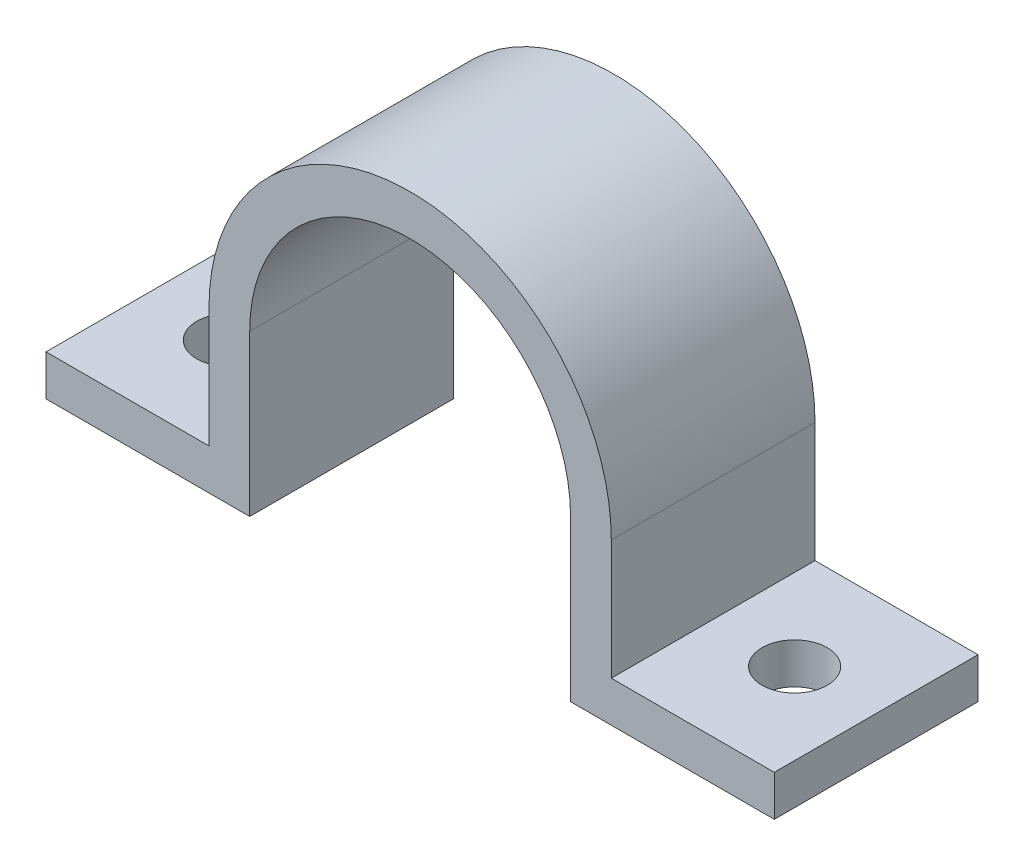
ISO-10303-21;
HEADER;
FILE_DESCRIPTION(('STEP AP214'),'2;1');
FILE_NAME('part.step','',(''),(''),'','','');
FILE_SCHEMA(('AUTOMOTIVE_DESIGN { 1 0 10303 214 1 1 1 1 }'));
ENDSEC;
DATA;
#1=APPLICATION_CONTEXT('core data for automotive mechanical design processes');
#2=APPLICATION_PROTOCOL_DEFINITION('international standard','automotive_design',2000,#1);
#3=PRODUCT_CONTEXT('',#1,'mechanical');
#4=PRODUCT('Part','Part','',(#3));
#5=PRODUCT_RELATED_PRODUCT_CATEGORY('part','',(#4));
#6=PRODUCT_DEFINITION_FORMATION('','',#4);
#7=PRODUCT_DEFINITION_CONTEXT('part definition',#1,'design');
#8=PRODUCT_DEFINITION('design','',#6,#7);
#9=PRODUCT_DEFINITION_SHAPE('','',#8);
#10=(LENGTH_UNIT() NAMED_UNIT(*) SI_UNIT(.MILLI.,.METRE.));
#11=(NAMED_UNIT(*) PLANE_ANGLE_UNIT() SI_UNIT($,.RADIAN.));
#12=(NAMED_UNIT(*) SI_UNIT($,.STERADIAN.) SOLID_ANGLE_UNIT());
#13=UNCERTAINTY_MEASURE_WITH_UNIT(LENGTH_MEASURE(1.E-05),#10,'distance_accuracy_value','');
#14=(GEOMETRIC_REPRESENTATION_CONTEXT(3) GLOBAL_UNCERTAINTY_ASSIGNED_CONTEXT((#13)) GLOBAL_UNIT_ASSIGNED_CONTEXT((#10,
#11,#12)) REPRESENTATION_CONTEXT('',''));
#15=CARTESIAN_POINT('',(0.,0.,0.));
#16=DIRECTION('',(0.,0.,1.));
#17=DIRECTION('',(1.,0.,0.));
#18=AXIS2_PLACEMENT_3D('',#15,#16,#17);
#19=CARTESIAN_POINT('',(0.836483509189198,-0.00257229477925586,12.7));
#20=DIRECTION('',(0.,0.,-1.));
#21=DIRECTION('',(-1.,0.,0.));
#22=AXIS2_PLACEMENT_3D('',#19,#20,#21);
#23=CYLINDRICAL_SURFACE('',#22,10.0000054);
#24=CARTESIAN_POINT('',(0.836483509189198,-0.00257229477925586,0.));
#25=DIRECTION('',(0.,0.,-1.));
#26=DIRECTION('',(-1.,0.,0.));
#27=AXIS2_PLACEMENT_3D('',#24,#25,#26);
#28=CIRCLE('',#27,10.0000054);
#29=CARTESIAN_POINT('',(-9.1635218908108,-0.00257229477925586,0.));
#30=VERTEX_POINT('',#29);
#31=CARTESIAN_POINT('',(10.8364889091892,-0.00257229477925218,0.));
#32=VERTEX_POINT('',#31);
#33=EDGE_CURVE('E182',#30,#32,#28,.T.);
#34=ORIENTED_EDGE('',*,*,#33,.T.);
#35=DIRECTION('',(0.,0.,-1.));
#36=VECTOR('',#35,1.);
#37=CARTESIAN_POINT('',(10.8364889091892,-0.00257229477925218,12.7));
#38=LINE('',#37,#36);
#39=CARTESIAN_POINT('',(10.8364889091892,-0.00257229477925218,12.7));
#40=VERTEX_POINT('',#39);
#41=EDGE_CURVE('E11',#40,#32,#38,.T.);
#42=ORIENTED_EDGE('',*,*,#41,.F.);
#43=CARTESIAN_POINT('',(0.836483509189198,-0.00257229477925586,12.7));
#44=DIRECTION('',(0.,0.,-1.));
#45=DIRECTION('',(-1.,0.,0.));
#46=AXIS2_PLACEMENT_3D('',#43,#44,#45);
#47=CIRCLE('',#46,10.0000054);
#48=CARTESIAN_POINT('',(-9.1635218908108,-0.00257229477925586,12.7));
#49=VERTEX_POINT('',#48);
#50=EDGE_CURVE('E217',#49,#40,#47,.T.);
#51=ORIENTED_EDGE('',*,*,#50,.F.);
#52=DIRECTION('',(0.,0.,-1.));
#53=VECTOR('',#52,1.);
#54=CARTESIAN_POINT('',(-9.1635218908108,-0.00257229477925586,12.7));
#55=LINE('',#54,#53);
#56=EDGE_CURVE('E178',#49,#30,#55,.T.);
#57=ORIENTED_EDGE('',*,*,#56,.T.);
#58=EDGE_LOOP('',(#34,#42,#51,#57));
#59=FACE_BOUND('',#58,.T.);
#60=ADVANCED_FACE('F43',(#59),#23,.F.);
#61=CARTESIAN_POINT('',(10.8364889091892,-0.00257229477925218,12.7));
#62=DIRECTION('',(1.,0.,0.));
#63=DIRECTION('',(0.,1.,0.));
#64=AXIS2_PLACEMENT_3D('',#61,#62,#63);
#65=PLANE('',#64);
#66=DIRECTION('',(0.,-1.,0.));
#67=VECTOR('',#66,1.);
#68=CARTESIAN_POINT('',(10.8364889091892,-0.00257229477925218,0.));
#69=LINE('',#68,#67);
#70=CARTESIAN_POINT('',(10.8364889091892,-10.0025776947793,0.));
#71=VERTEX_POINT('',#70);
#72=EDGE_CURVE('E186',#32,#71,#69,.T.);
#73=ORIENTED_EDGE('',*,*,#72,.T.);
#74=DIRECTION('',(0.,0.,-1.));
#75=VECTOR('',#74,1.);
#76=CARTESIAN_POINT('',(10.8364889091892,-10.0025776947793,12.7));
#77=LINE('',#76,#75);
#78=CARTESIAN_POINT('',(10.8364889091892,-10.0025776947793,12.7));
#79=VERTEX_POINT('',#78);
#80=EDGE_CURVE('E53',#79,#71,#77,.T.);
#81=ORIENTED_EDGE('',*,*,#80,.F.);
#82=DIRECTION('',(0.,-1.,0.));
#83=VECTOR('',#82,1.);
#84=CARTESIAN_POINT('',(10.8364889091892,-0.00257229477925218,12.7));
#85=LINE('',#84,#83);
#86=EDGE_CURVE('E127',#40,#79,#85,.T.);
#87=ORIENTED_EDGE('',*,*,#86,.F.);
#88=ORIENTED_EDGE('',*,*,#41,.T.);
#89=EDGE_LOOP('',(#73,#81,#87,#88));
#90=FACE_BOUND('',#89,.T.);
#91=ADVANCED_FACE('F313',(#90),#65,.F.);
#92=CARTESIAN_POINT('',(10.8364889091892,-10.0025776947793,12.7));
#93=DIRECTION('',(0.,1.,0.));
#94=DIRECTION('',(0.,0.,1.));
#95=AXIS2_PLACEMENT_3D('',#92,#93,#94);
#96=PLANE('',#95);
#97=CARTESIAN_POINT('',(18.4564889091892,-10.0025776947793,6.35));
#98=DIRECTION('',(0.,1.,0.));
#99=DIRECTION('',(0.,0.,1.));
#100=AXIS2_PLACEMENT_3D('',#97,#98,#99);
#101=CIRCLE('',#100,2.032);
#102=CARTESIAN_POINT('',(18.4564889091892,-10.0025776947793,8.382));
#103=VERTEX_POINT('',#102);
#104=EDGE_CURVE('E187',#103,#103,#101,.T.);
#105=ORIENTED_EDGE('',*,*,#104,.T.);
#106=EDGE_LOOP('',(#105));
#107=FACE_BOUND('',#106,.T.);
#108=DIRECTION('',(1.,0.,0.));
#109=VECTOR('',#108,1.);
#110=CARTESIAN_POINT('',(10.8364889091892,-10.0025776947793,0.));
#111=LINE('',#110,#109);
#112=CARTESIAN_POINT('',(23.5364889091892,-10.0025776947793,0.));
#113=VERTEX_POINT('',#112);
#114=EDGE_CURVE('E190',#71,#113,#111,.T.);
#115=ORIENTED_EDGE('',*,*,#114,.T.);
#116=DIRECTION('',(0.,0.,-1.));
#117=VECTOR('',#116,1.);
#118=CARTESIAN_POINT('',(23.5364889091892,-10.0025776947793,12.7));
#119=LINE('',#118,#117);
#120=CARTESIAN_POINT('',(23.5364889091892,-10.0025776947793,12.7));
#121=VERTEX_POINT('',#120);
#122=EDGE_CURVE('E244',#121,#113,#119,.T.);
#123=ORIENTED_EDGE('',*,*,#122,.F.);
#124=DIRECTION('',(1.,0.,0.));
#125=VECTOR('',#124,1.);
#126=CARTESIAN_POINT('',(10.8364889091892,-10.0025776947793,12.7));
#127=LINE('',#126,#125);
#128=EDGE_CURVE('E255',#79,#121,#127,.T.);
#129=ORIENTED_EDGE('',*,*,#128,.F.);
#130=ORIENTED_EDGE('',*,*,#80,.T.);
#131=EDGE_LOOP('',(#115,#123,#129,#130));
#132=FACE_BOUND('',#131,.T.);
#133=ADVANCED_FACE('F253',(#107,#132),#96,.F.);
#134=CARTESIAN_POINT('',(23.5364889091892,-10.0025776947793,12.7));
#135=DIRECTION('',(-1.,0.,0.));
#136=DIRECTION('',(0.,0.,1.));
#137=AXIS2_PLACEMENT_3D('',#134,#135,#136);
#138=PLANE('',#137);
#139=DIRECTION('',(0.,1.,0.));
#140=VECTOR('',#139,1.);
#141=CARTESIAN_POINT('',(23.5364889091892,-10.0025776947793,0.));
#142=LINE('',#141,#140);
#143=CARTESIAN_POINT('',(23.5364889091892,-7.46257769477926,0.));
#144=VERTEX_POINT('',#143);
#145=EDGE_CURVE('E193',#113,#144,#142,.T.);
#146=ORIENTED_EDGE('',*,*,#145,.T.);
#147=DIRECTION('',(0.,0.,-1.));
#148=VECTOR('',#147,1.);
#149=CARTESIAN_POINT('',(23.5364889091892,-7.46257769477926,12.7));
#150=LINE('',#149,#148);
#151=CARTESIAN_POINT('',(23.5364889091892,-7.46257769477926,12.7));
#152=VERTEX_POINT('',#151);
#153=EDGE_CURVE('E240',#152,#144,#150,.T.);
#154=ORIENTED_EDGE('',*,*,#153,.F.);
#155=DIRECTION('',(0.,1.,0.));
#156=VECTOR('',#155,1.);
#157=CARTESIAN_POINT('',(23.5364889091892,-10.0025776947793,12.7));
#158=LINE('',#157,#156);
#159=EDGE_CURVE('E274',#121,#152,#158,.T.);
#160=ORIENTED_EDGE('',*,*,#159,.F.);
#161=ORIENTED_EDGE('',*,*,#122,.T.);
#162=EDGE_LOOP('',(#146,#154,#160,#161));
#163=FACE_BOUND('',#162,.T.);
#164=ADVANCED_FACE('F264',(#163),#138,.F.);
#165=CARTESIAN_POINT('',(13.3764889091892,-7.46257769477926,12.7));
#166=DIRECTION('',(0.,-1.,0.));
#167=DIRECTION('',(1.,0.,0.));
#168=AXIS2_PLACEMENT_3D('',#165,#166,#167);
#169=PLANE('',#168);
#170=CARTESIAN_POINT('',(18.4564889091892,-7.46257769477926,6.35));
#171=DIRECTION('',(0.,1.,0.));
#172=DIRECTION('',(0.,0.,1.));
#173=AXIS2_PLACEMENT_3D('',#170,#171,#172);
#174=CIRCLE('',#173,2.032);
#175=CARTESIAN_POINT('',(18.4564889091892,-7.46257769477926,8.382));
#176=VERTEX_POINT('',#175);
#177=EDGE_CURVE('E425',#176,#176,#174,.T.);
#178=ORIENTED_EDGE('',*,*,#177,.F.);
#179=EDGE_LOOP('',(#178));
#180=FACE_BOUND('',#179,.T.);
#181=DIRECTION('',(-1.,0.,0.));
#182=VECTOR('',#181,1.);
#183=CARTESIAN_POINT('',(13.3764889091892,-7.46257769477926,0.));
#184=LINE('',#183,#182);
#185=CARTESIAN_POINT('',(13.3764889091892,-7.46257769477926,0.));
#186=VERTEX_POINT('',#185);
#187=EDGE_CURVE('E196',#144,#186,#184,.T.);
#188=ORIENTED_EDGE('',*,*,#187,.T.);
#189=DIRECTION('',(0.,0.,-1.));
#190=VECTOR('',#189,1.);
#191=CARTESIAN_POINT('',(13.3764889091892,-7.46257769477926,12.7));
#192=LINE('',#191,#190);
#193=CARTESIAN_POINT('',(13.3764889091892,-7.46257769477926,12.7));
#194=VERTEX_POINT('',#193);
#195=EDGE_CURVE('E236',#194,#186,#192,.T.);
#196=ORIENTED_EDGE('',*,*,#195,.F.);
#197=DIRECTION('',(-1.,0.,0.));
#198=VECTOR('',#197,1.);
#199=CARTESIAN_POINT('',(13.3764889091892,-7.46257769477926,12.7));
#200=LINE('',#199,#198);
#201=EDGE_CURVE('E270',#152,#194,#200,.T.);
#202=ORIENTED_EDGE('',*,*,#201,.F.);
#203=ORIENTED_EDGE('',*,*,#153,.T.);
#204=EDGE_LOOP('',(#188,#196,#202,#203));
#205=FACE_BOUND('',#204,.T.);
#206=ADVANCED_FACE('F268',(#180,#205),#169,.F.);
#207=CARTESIAN_POINT('',(13.3764889091892,-0.00257229477925586,12.7));
#208=DIRECTION('',(-1.,0.,0.));
#209=DIRECTION('',(0.,-1.,0.));
#210=AXIS2_PLACEMENT_3D('',#207,#208,#209);
#211=PLANE('',#210);
#212=DIRECTION('',(0.,1.,0.));
#213=VECTOR('',#212,1.);
#214=CARTESIAN_POINT('',(13.3764889091892,-0.00257229477925586,0.));
#215=LINE('',#214,#213);
#216=CARTESIAN_POINT('',(13.3764889091892,-0.00257229477925586,0.));
#217=VERTEX_POINT('',#216);
#218=EDGE_CURVE('E199',#186,#217,#215,.T.);
#219=ORIENTED_EDGE('',*,*,#218,.T.);
#220=DIRECTION('',(0.,0.,-1.));
#221=VECTOR('',#220,1.);
#222=CARTESIAN_POINT('',(13.3764889091892,-0.00257229477925586,12.7));
#223=LINE('',#222,#221);
#224=CARTESIAN_POINT('',(13.3764889091892,-0.00257229477925586,12.7));
#225=VERTEX_POINT('',#224);
#226=EDGE_CURVE('E232',#225,#217,#223,.T.);
#227=ORIENTED_EDGE('',*,*,#226,.F.);
#228=DIRECTION('',(0.,1.,0.));
#229=VECTOR('',#228,1.);
#230=CARTESIAN_POINT('',(13.3764889091892,-0.00257229477925586,12.7));
#231=LINE('',#230,#229);
#232=EDGE_CURVE('E273',#194,#225,#231,.T.);
#233=ORIENTED_EDGE('',*,*,#232,.F.);
#234=ORIENTED_EDGE('',*,*,#195,.T.);
#235=EDGE_LOOP('',(#219,#227,#233,#234));
#236=FACE_BOUND('',#235,.T.);
#237=ADVANCED_FACE('F327',(#236),#211,.F.);
#238=CARTESIAN_POINT('',(0.836483509189198,-0.00257229477925586,12.7));
#239=DIRECTION('',(0.,0.,-1.));
#240=DIRECTION('',(-1.,0.,0.));
#241=AXIS2_PLACEMENT_3D('',#238,#239,#240);
#242=CYLINDRICAL_SURFACE('',#241,12.5400054);
#243=CARTESIAN_POINT('',(0.836483509189198,-0.00257229477925586,0.));
#244=DIRECTION('',(0.,0.,1.));
#245=DIRECTION('',(-1.,0.,0.));
#246=AXIS2_PLACEMENT_3D('',#243,#244,#245);
#247=CIRCLE('',#246,12.5400054);
#248=CARTESIAN_POINT('',(-11.7035218908108,-0.00257229477925586,0.));
#249=VERTEX_POINT('',#248);
#250=EDGE_CURVE('E202',#217,#249,#247,.T.);
#251=ORIENTED_EDGE('',*,*,#250,.T.);
#252=DIRECTION('',(0.,0.,-1.));
#253=VECTOR('',#252,1.);
#254=CARTESIAN_POINT('',(-11.7035218908108,-0.00257229477925586,12.7));
#255=LINE('',#254,#253);
#256=CARTESIAN_POINT('',(-11.7035218908108,-0.00257229477925586,12.7));
#257=VERTEX_POINT('',#256);
#258=EDGE_CURVE('E228',#257,#249,#255,.T.);
#259=ORIENTED_EDGE('',*,*,#258,.F.);
#260=CARTESIAN_POINT('',(0.836483509189198,-0.00257229477925586,12.7));
#261=DIRECTION('',(0.,0.,1.));
#262=DIRECTION('',(-1.,0.,0.));
#263=AXIS2_PLACEMENT_3D('',#260,#261,#262);
#264=CIRCLE('',#263,12.5400054);
#265=EDGE_CURVE('E278',#225,#257,#264,.T.);
#266=ORIENTED_EDGE('',*,*,#265,.F.);
#267=ORIENTED_EDGE('',*,*,#226,.T.);
#268=EDGE_LOOP('',(#251,#259,#266,#267));
#269=FACE_BOUND('',#268,.T.);
#270=ADVANCED_FACE('F331',(#269),#242,.T.);
#271=CARTESIAN_POINT('',(-11.7035218908108,-0.00257229477925586,12.7));
#272=DIRECTION('',(1.,0.,0.));
#273=DIRECTION('',(0.,1.,0.));
#274=AXIS2_PLACEMENT_3D('',#271,#272,#273);
#275=PLANE('',#274);
#276=DIRECTION('',(0.,-1.,0.));
#277=VECTOR('',#276,1.);
#278=CARTESIAN_POINT('',(-11.7035218908108,-0.00257229477925586,0.));
#279=LINE('',#278,#277);
#280=CARTESIAN_POINT('',(-11.7035218908108,-7.46257769477926,0.));
#281=VERTEX_POINT('',#280);
#282=EDGE_CURVE('E205',#249,#281,#279,.T.);
#283=ORIENTED_EDGE('',*,*,#282,.T.);
#284=DIRECTION('',(0.,0.,-1.));
#285=VECTOR('',#284,1.);
#286=CARTESIAN_POINT('',(-11.7035218908108,-7.46257769477926,12.7));
#287=LINE('',#286,#285);
#288=CARTESIAN_POINT('',(-11.7035218908108,-7.46257769477926,12.7));
#289=VERTEX_POINT('',#288);
#290=EDGE_CURVE('E224',#289,#281,#287,.T.);
#291=ORIENTED_EDGE('',*,*,#290,.F.);
#292=DIRECTION('',(0.,-1.,0.));
#293=VECTOR('',#292,1.);
#294=CARTESIAN_POINT('',(-11.7035218908108,-0.00257229477925586,12.7));
#295=LINE('',#294,#293);
#296=EDGE_CURVE('E285',#257,#289,#295,.T.);
#297=ORIENTED_EDGE('',*,*,#296,.F.);
#298=ORIENTED_EDGE('',*,*,#258,.T.);
#299=EDGE_LOOP('',(#283,#291,#297,#298));
#300=FACE_BOUND('',#299,.T.);
#301=ADVANCED_FACE('F293',(#300),#275,.F.);
#302=CARTESIAN_POINT('',(-21.8635218908108,-7.46257769477926,12.7));
#303=DIRECTION('',(0.,-1.,0.));
#304=DIRECTION('',(0.,0.,-1.));
#305=AXIS2_PLACEMENT_3D('',#302,#303,#304);
#306=PLANE('',#305);
#307=CARTESIAN_POINT('',(-16.7835218908108,-7.46257769477926,6.35));
#308=DIRECTION('',(0.,1.,0.));
#309=DIRECTION('',(0.,0.,1.));
#310=AXIS2_PLACEMENT_3D('',#307,#308,#309);
#311=CIRCLE('',#310,2.032);
#312=CARTESIAN_POINT('',(-16.7835218908108,-7.46257769477926,8.382));
#313=VERTEX_POINT('',#312);
#314=EDGE_CURVE('E432',#313,#313,#311,.T.);
#315=ORIENTED_EDGE('',*,*,#314,.F.);
#316=EDGE_LOOP('',(#315));
#317=FACE_BOUND('',#316,.T.);
#318=DIRECTION('',(-1.,0.,0.));
#319=VECTOR('',#318,1.);
#320=CARTESIAN_POINT('',(-21.8635218908108,-7.46257769477926,0.));
#321=LINE('',#320,#319);
#322=CARTESIAN_POINT('',(-21.8635218908108,-7.46257769477926,0.));
#323=VERTEX_POINT('',#322);
#324=EDGE_CURVE('E208',#281,#323,#321,.T.);
#325=ORIENTED_EDGE('',*,*,#324,.T.);
#326=DIRECTION('',(0.,0.,-1.));
#327=VECTOR('',#326,1.);
#328=CARTESIAN_POINT('',(-21.8635218908108,-7.46257769477926,12.7));
#329=LINE('',#328,#327);
#330=CARTESIAN_POINT('',(-21.8635218908108,-7.46257769477926,12.7));
#331=VERTEX_POINT('',#330);
#332=EDGE_CURVE('E171',#331,#323,#329,.T.);
#333=ORIENTED_EDGE('',*,*,#332,.F.);
#334=DIRECTION('',(-1.,0.,0.));
#335=VECTOR('',#334,1.);
#336=CARTESIAN_POINT('',(-21.8635218908108,-7.46257769477926,12.7));
#337=LINE('',#336,#335);
#338=EDGE_CURVE('E160',#289,#331,#337,.T.);
#339=ORIENTED_EDGE('',*,*,#338,.F.);
#340=ORIENTED_EDGE('',*,*,#290,.T.);
#341=EDGE_LOOP('',(#325,#333,#339,#340));
#342=FACE_BOUND('',#341,.T.);
#343=ADVANCED_FACE('F297',(#317,#342),#306,.F.);
#344=CARTESIAN_POINT('',(-21.8635218908108,-10.0025776947793,12.7));
#345=DIRECTION('',(1.,0.,0.));
#346=DIRECTION('',(0.,0.,-1.));
#347=AXIS2_PLACEMENT_3D('',#344,#345,#346);
#348=PLANE('',#347);
#349=DIRECTION('',(0.,-1.,0.));
#350=VECTOR('',#349,1.);
#351=CARTESIAN_POINT('',(-21.8635218908108,-10.0025776947793,0.));
#352=LINE('',#351,#350);
#353=CARTESIAN_POINT('',(-21.8635218908108,-10.0025776947793,0.));
#354=VERTEX_POINT('',#353);
#355=EDGE_CURVE('E169',#323,#354,#352,.T.);
#356=ORIENTED_EDGE('',*,*,#355,.T.);
#357=DIRECTION('',(0.,0.,-1.));
#358=VECTOR('',#357,1.);
#359=CARTESIAN_POINT('',(-21.8635218908108,-10.0025776947793,12.7));
#360=LINE('',#359,#358);
#361=CARTESIAN_POINT('',(-21.8635218908108,-10.0025776947793,12.7));
#362=VERTEX_POINT('',#361);
#363=EDGE_CURVE('E166',#362,#354,#360,.T.);
#364=ORIENTED_EDGE('',*,*,#363,.F.);
#365=DIRECTION('',(0.,-1.,0.));
#366=VECTOR('',#365,1.);
#367=CARTESIAN_POINT('',(-21.8635218908108,-10.0025776947793,12.7));
#368=LINE('',#367,#366);
#369=EDGE_CURVE('E154',#331,#362,#368,.T.);
#370=ORIENTED_EDGE('',*,*,#369,.F.);
#371=ORIENTED_EDGE('',*,*,#332,.T.);
#372=EDGE_LOOP('',(#356,#364,#370,#371));
#373=FACE_BOUND('',#372,.T.);
#374=ADVANCED_FACE('F167',(#373),#348,.F.);
#375=CARTESIAN_POINT('',(-9.1635218908108,-10.0025776947793,12.7));
#376=DIRECTION('',(0.,1.,0.));
#377=DIRECTION('',(0.,0.,1.));
#378=AXIS2_PLACEMENT_3D('',#375,#376,#377);
#379=PLANE('',#378);
#380=CARTESIAN_POINT('',(-16.7835218908108,-10.0025776947793,6.35));
#381=DIRECTION('',(0.,1.,0.));
#382=DIRECTION('',(0.,0.,1.));
#383=AXIS2_PLACEMENT_3D('',#380,#381,#382);
#384=CIRCLE('',#383,2.032);
#385=CARTESIAN_POINT('',(-16.7835218908108,-10.0025776947793,8.382));
#386=VERTEX_POINT('',#385);
#387=EDGE_CURVE('E46',#386,#386,#384,.T.);
#388=ORIENTED_EDGE('',*,*,#387,.T.);
#389=EDGE_LOOP('',(#388));
#390=FACE_BOUND('',#389,.T.);
#391=DIRECTION('',(1.,0.,0.));
#392=VECTOR('',#391,1.);
#393=CARTESIAN_POINT('',(-9.1635218908108,-10.0025776947793,0.));
#394=LINE('',#393,#392);
#395=CARTESIAN_POINT('',(-9.1635218908108,-10.0025776947793,0.));
#396=VERTEX_POINT('',#395);
#397=EDGE_CURVE('E113',#354,#396,#394,.T.);
#398=ORIENTED_EDGE('',*,*,#397,.T.);
#399=DIRECTION('',(0.,0.,-1.));
#400=VECTOR('',#399,1.);
#401=CARTESIAN_POINT('',(-9.1635218908108,-10.0025776947793,12.7));
#402=LINE('',#401,#400);
#403=CARTESIAN_POINT('',(-9.1635218908108,-10.0025776947793,12.7));
#404=VERTEX_POINT('',#403);
#405=EDGE_CURVE('E172',#404,#396,#402,.T.);
#406=ORIENTED_EDGE('',*,*,#405,.F.);
#407=DIRECTION('',(1.,0.,0.));
#408=VECTOR('',#407,1.);
#409=CARTESIAN_POINT('',(-9.1635218908108,-10.0025776947793,12.7));
#410=LINE('',#409,#408);
#411=EDGE_CURVE('E158',#362,#404,#410,.T.);
#412=ORIENTED_EDGE('',*,*,#411,.F.);
#413=ORIENTED_EDGE('',*,*,#363,.T.);
#414=EDGE_LOOP('',(#398,#406,#412,#413));
#415=FACE_BOUND('',#414,.T.);
#416=ADVANCED_FACE('F174',(#390,#415),#379,.F.);
#417=CARTESIAN_POINT('',(-9.1635218908108,-0.00257229477925586,12.7));
#418=DIRECTION('',(-1.,0.,0.));
#419=DIRECTION('',(0.,0.,1.));
#420=AXIS2_PLACEMENT_3D('',#417,#418,#419);
#421=PLANE('',#420);
#422=DIRECTION('',(0.,1.,0.));
#423=VECTOR('',#422,1.);
#424=CARTESIAN_POINT('',(-9.1635218908108,-0.00257229477925586,0.));
#425=LINE('',#424,#423);
#426=EDGE_CURVE('E119',#396,#30,#425,.T.);
#427=ORIENTED_EDGE('',*,*,#426,.T.);
#428=ORIENTED_EDGE('',*,*,#56,.F.);
#429=DIRECTION('',(0.,1.,0.));
#430=VECTOR('',#429,1.);
#431=CARTESIAN_POINT('',(-9.1635218908108,-0.00257229477925586,12.7));
#432=LINE('',#431,#430);
#433=EDGE_CURVE('E64',#404,#49,#432,.T.);
#434=ORIENTED_EDGE('',*,*,#433,.F.);
#435=ORIENTED_EDGE('',*,*,#405,.T.);
#436=EDGE_LOOP('',(#427,#428,#434,#435));
#437=FACE_BOUND('',#436,.T.);
#438=ADVANCED_FACE('F301',(#437),#421,.F.);
#439=CARTESIAN_POINT('',(0.836483509189198,-0.00257229477925586,12.7));
#440=DIRECTION('',(0.,0.,-1.));
#441=DIRECTION('',(-1.,0.,0.));
#442=AXIS2_PLACEMENT_3D('',#439,#440,#441);
#443=PLANE('',#442);
#444=ORIENTED_EDGE('',*,*,#50,.T.);
#445=ORIENTED_EDGE('',*,*,#86,.T.);
#446=ORIENTED_EDGE('',*,*,#128,.T.);
#447=ORIENTED_EDGE('',*,*,#159,.T.);
#448=ORIENTED_EDGE('',*,*,#201,.T.);
#449=ORIENTED_EDGE('',*,*,#232,.T.);
#450=ORIENTED_EDGE('',*,*,#265,.T.);
#451=ORIENTED_EDGE('',*,*,#296,.T.);
#452=ORIENTED_EDGE('',*,*,#338,.T.);
#453=ORIENTED_EDGE('',*,*,#369,.T.);
#454=ORIENTED_EDGE('',*,*,#411,.T.);
#455=ORIENTED_EDGE('',*,*,#433,.T.);
#456=EDGE_LOOP('',(#444,#445,#446,#447,#448,#449,#450,#451,#452,#453,#454,#455));
#457=FACE_BOUND('',#456,.T.);
#458=ADVANCED_FACE('F156',(#457),#443,.F.);
#459=CARTESIAN_POINT('',(0.836483509189198,-0.00257229477925586,0.));
#460=DIRECTION('',(0.,0.,-1.));
#461=DIRECTION('',(-1.,0.,0.));
#462=AXIS2_PLACEMENT_3D('',#459,#460,#461);
#463=PLANE('',#462);
#464=ORIENTED_EDGE('',*,*,#33,.F.);
#465=ORIENTED_EDGE('',*,*,#426,.F.);
#466=ORIENTED_EDGE('',*,*,#397,.F.);
#467=ORIENTED_EDGE('',*,*,#355,.F.);
#468=ORIENTED_EDGE('',*,*,#324,.F.);
#469=ORIENTED_EDGE('',*,*,#282,.F.);
#470=ORIENTED_EDGE('',*,*,#250,.F.);
#471=ORIENTED_EDGE('',*,*,#218,.F.);
#472=ORIENTED_EDGE('',*,*,#187,.F.);
#473=ORIENTED_EDGE('',*,*,#145,.F.);
#474=ORIENTED_EDGE('',*,*,#114,.F.);
#475=ORIENTED_EDGE('',*,*,#72,.F.);
#476=EDGE_LOOP('',(#464,#465,#466,#467,#468,#469,#470,#471,#472,#473,#474,#475));
#477=FACE_BOUND('',#476,.T.);
#478=ADVANCED_FACE('F259',(#477),#463,.T.);
#479=CARTESIAN_POINT('',(-16.7835218908108,-20.1625776947793,6.35));
#480=DIRECTION('',(0.,1.,0.));
#481=DIRECTION('',(0.,0.,1.));
#482=AXIS2_PLACEMENT_3D('',#479,#480,#481);
#483=CYLINDRICAL_SURFACE('',#482,2.032);
#484=ORIENTED_EDGE('',*,*,#314,.T.);
#485=EDGE_LOOP('',(#484));
#486=FACE_BOUND('',#485,.T.);
#487=ORIENTED_EDGE('',*,*,#387,.F.);
#488=EDGE_LOOP('',(#487));
#489=FACE_BOUND('',#488,.T.);
#490=ADVANCED_FACE('F387',(#486,#489),#483,.F.);
#491=CARTESIAN_POINT('',(18.4564889091892,-20.1625776947793,6.35));
#492=DIRECTION('',(0.,1.,0.));
#493=DIRECTION('',(0.,0.,1.));
#494=AXIS2_PLACEMENT_3D('',#491,#492,#493);
#495=CYLINDRICAL_SURFACE('',#494,2.032);
#496=ORIENTED_EDGE('',*,*,#177,.T.);
#497=EDGE_LOOP('',(#496));
#498=FACE_BOUND('',#497,.T.);
#499=ORIENTED_EDGE('',*,*,#104,.F.);
#500=EDGE_LOOP('',(#499));
#501=FACE_BOUND('',#500,.T.);
#502=ADVANCED_FACE('F408',(#498,#501),#495,.F.);
#503=CLOSED_SHELL('',(#60,#91,#133,#164,#206,#237,#270,#301,#343,#374,#416,#438,#458,#478,#490,#502));
#504=MANIFOLD_SOLID_BREP('B2',#503);
#505=ADVANCED_BREP_SHAPE_REPRESENTATION('',(#18,#504),#14);
#506=SHAPE_DEFINITION_REPRESENTATION(#9,#505);
ENDSEC;
END-ISO-10303-21;
